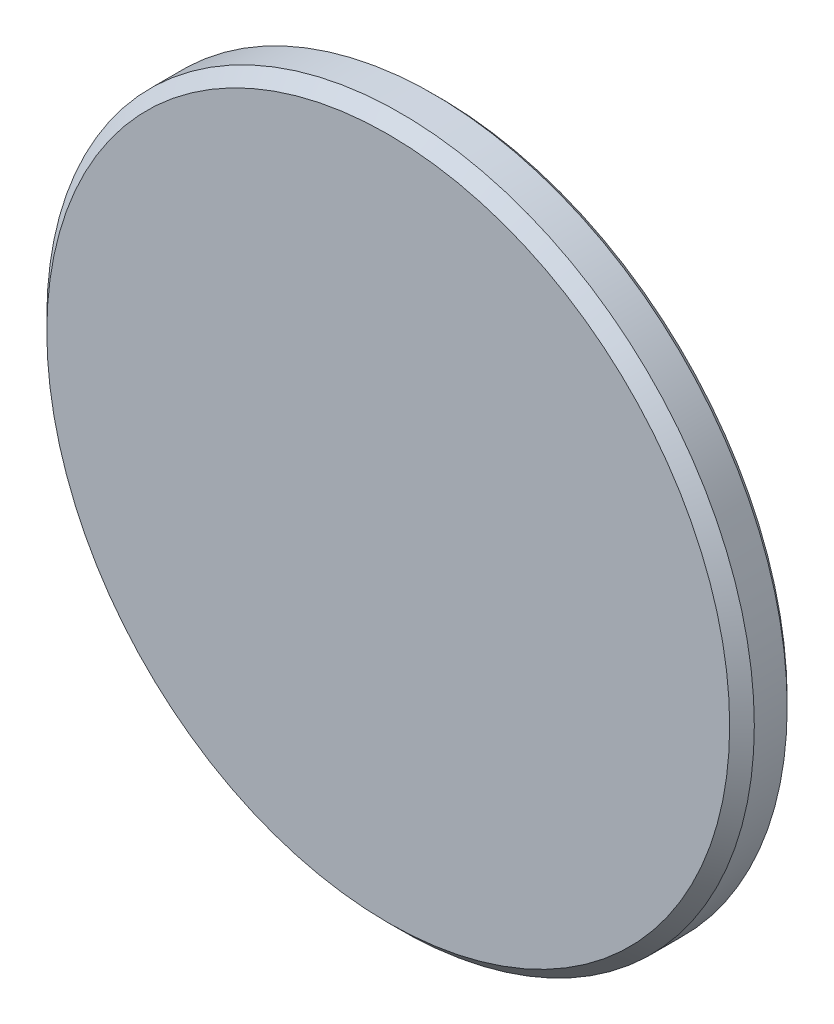
ISO-10303-21;
HEADER;
FILE_DESCRIPTION(('STEP AP214'),'2;1');
FILE_NAME('part.step','',(''),(''),'','','');
FILE_SCHEMA(('AUTOMOTIVE_DESIGN { 1 0 10303 214 1 1 1 1 }'));
ENDSEC;
DATA;
#1=APPLICATION_CONTEXT('core data for automotive mechanical design processes');
#2=APPLICATION_PROTOCOL_DEFINITION('international standard','automotive_design',2000,#1);
#3=PRODUCT_CONTEXT('',#1,'mechanical');
#4=PRODUCT('Part','Part','',(#3));
#5=PRODUCT_RELATED_PRODUCT_CATEGORY('part','',(#4));
#6=PRODUCT_DEFINITION_FORMATION('','',#4);
#7=PRODUCT_DEFINITION_CONTEXT('part definition',#1,'design');
#8=PRODUCT_DEFINITION('design','',#6,#7);
#9=PRODUCT_DEFINITION_SHAPE('','',#8);
#10=(LENGTH_UNIT() NAMED_UNIT(*) SI_UNIT(.MILLI.,.METRE.));
#11=(NAMED_UNIT(*) PLANE_ANGLE_UNIT() SI_UNIT($,.RADIAN.));
#12=(NAMED_UNIT(*) SI_UNIT($,.STERADIAN.) SOLID_ANGLE_UNIT());
#13=UNCERTAINTY_MEASURE_WITH_UNIT(LENGTH_MEASURE(1.E-05),#10,'distance_accuracy_value','');
#14=(GEOMETRIC_REPRESENTATION_CONTEXT(3) GLOBAL_UNCERTAINTY_ASSIGNED_CONTEXT((#13)) GLOBAL_UNIT_ASSIGNED_CONTEXT((#10,
#11,#12)) REPRESENTATION_CONTEXT('',''));
#15=CARTESIAN_POINT('',(0.,0.,0.));
#16=DIRECTION('',(0.,0.,1.));
#17=DIRECTION('',(1.,0.,0.));
#18=AXIS2_PLACEMENT_3D('',#15,#16,#17);
#19=CARTESIAN_POINT('',(0.,0.,0.380999999999965));
#20=DIRECTION('',(0.,0.,0.999999999999998));
#21=DIRECTION('',(0.999999999999998,0.,0.));
#22=AXIS2_PLACEMENT_3D('',#19,#20,#21);
#23=CONICAL_SURFACE('',#22,21.8694,0.785398163397448);
#24=CARTESIAN_POINT('',(0.,0.,0.));
#25=DIRECTION('',(0.,0.,0.999999999999998));
#26=DIRECTION('',(0.999999999999998,0.,0.));
#27=AXIS2_PLACEMENT_3D('',#24,#25,#26);
#28=CIRCLE('',#27,21.4884);
#29=CARTESIAN_POINT('',(21.4884,0.,0.));
#30=VERTEX_POINT('',#29);
#31=EDGE_CURVE('E40',#30,#30,#28,.T.);
#32=ORIENTED_EDGE('',*,*,#31,.T.);
#33=EDGE_LOOP('',(#32));
#34=FACE_BOUND('',#33,.T.);
#35=CARTESIAN_POINT('',(0.,0.,0.380999999999965));
#36=DIRECTION('',(0.,0.,0.999999999999998));
#37=DIRECTION('',(0.999999999999998,0.,0.));
#38=AXIS2_PLACEMENT_3D('',#35,#36,#37);
#39=CIRCLE('',#38,21.8694);
#40=CARTESIAN_POINT('',(21.8694,0.,0.380999999999966));
#41=VERTEX_POINT('',#40);
#42=EDGE_CURVE('E10',#41,#41,#39,.T.);
#43=ORIENTED_EDGE('',*,*,#42,.F.);
#44=EDGE_LOOP('',(#43));
#45=FACE_BOUND('',#44,.T.);
#46=ADVANCED_FACE('F26',(#34,#45),#23,.T.);
#47=CARTESIAN_POINT('',(0.,0.,0.));
#48=DIRECTION('',(0.,0.,0.999999999999998));
#49=DIRECTION('',(0.999999999999998,0.,0.));
#50=AXIS2_PLACEMENT_3D('',#47,#48,#49);
#51=CYLINDRICAL_SURFACE('',#50,21.8694);
#52=ORIENTED_EDGE('',*,*,#42,.T.);
#53=EDGE_LOOP('',(#52));
#54=FACE_BOUND('',#53,.T.);
#55=CARTESIAN_POINT('',(0.,0.,2.413));
#56=DIRECTION('',(0.,0.,0.999999999999998));
#57=DIRECTION('',(0.999999999999998,0.,0.));
#58=AXIS2_PLACEMENT_3D('',#55,#56,#57);
#59=CIRCLE('',#58,21.8694);
#60=CARTESIAN_POINT('',(21.8693999999999,0.,2.413));
#61=VERTEX_POINT('',#60);
#62=EDGE_CURVE('E32',#61,#61,#59,.T.);
#63=ORIENTED_EDGE('',*,*,#62,.F.);
#64=EDGE_LOOP('',(#63));
#65=FACE_BOUND('',#64,.T.);
#66=ADVANCED_FACE('F59',(#54,#65),#51,.T.);
#67=CARTESIAN_POINT('',(0.,0.,3.17500000000009));
#68=DIRECTION('',(0.,0.,-0.999999999999998));
#69=DIRECTION('',(-0.999999999999998,0.,0.));
#70=AXIS2_PLACEMENT_3D('',#67,#68,#69);
#71=CONICAL_SURFACE('',#70,21.1074,0.785398163397446);
#72=ORIENTED_EDGE('',*,*,#62,.T.);
#73=EDGE_LOOP('',(#72));
#74=FACE_BOUND('',#73,.T.);
#75=CARTESIAN_POINT('',(0.,0.,3.17500000000009));
#76=DIRECTION('',(0.,0.,0.999999999999998));
#77=DIRECTION('',(0.999999999999998,0.,0.));
#78=AXIS2_PLACEMENT_3D('',#75,#76,#77);
#79=CIRCLE('',#78,21.1074);
#80=CARTESIAN_POINT('',(21.1074,0.,3.1750000000001));
#81=VERTEX_POINT('',#80);
#82=EDGE_CURVE('E36',#81,#81,#79,.T.);
#83=ORIENTED_EDGE('',*,*,#82,.F.);
#84=EDGE_LOOP('',(#83));
#85=FACE_BOUND('',#84,.T.);
#86=ADVANCED_FACE('F55',(#74,#85),#71,.T.);
#87=CARTESIAN_POINT('',(0.,0.,3.17500000000009));
#88=DIRECTION('',(0.,0.,0.999999999999998));
#89=DIRECTION('',(0.999999999999998,0.,0.));
#90=AXIS2_PLACEMENT_3D('',#87,#88,#89);
#91=PLANE('',#90);
#92=ORIENTED_EDGE('',*,*,#82,.T.);
#93=EDGE_LOOP('',(#92));
#94=FACE_BOUND('',#93,.T.);
#95=ADVANCED_FACE('F50',(#94),#91,.T.);
#96=CARTESIAN_POINT('',(21.4883999999999,1.2490009027033E-13,0.));
#97=DIRECTION('',(0.,0.,-0.999999999999998));
#98=DIRECTION('',(-0.999999999999998,0.,0.));
#99=AXIS2_PLACEMENT_3D('',#96,#97,#98);
#100=PLANE('',#99);
#101=ORIENTED_EDGE('',*,*,#31,.F.);
#102=EDGE_LOOP('',(#101));
#103=FACE_BOUND('',#102,.T.);
#104=ADVANCED_FACE('F48',(#103),#100,.T.);
#105=CLOSED_SHELL('',(#46,#66,#86,#95,#104));
#106=MANIFOLD_SOLID_BREP('B2',#105);
#107=ADVANCED_BREP_SHAPE_REPRESENTATION('',(#18,#106),#14);
#108=SHAPE_DEFINITION_REPRESENTATION(#9,#107);
ENDSEC;
END-ISO-10303-21;
